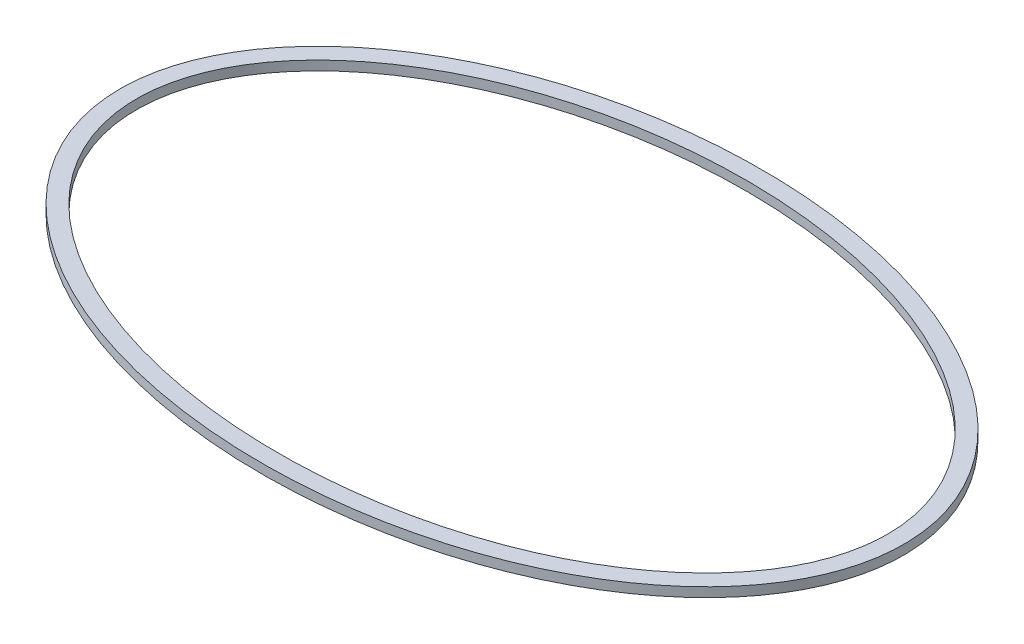
ISO-10303-21;
HEADER;
FILE_DESCRIPTION(('STEP AP214'),'2;1');
FILE_NAME('part.step','',(''),(''),'','','');
FILE_SCHEMA(('AUTOMOTIVE_DESIGN { 1 0 10303 214 1 1 1 1 }'));
ENDSEC;
DATA;
#1=APPLICATION_CONTEXT('core data for automotive mechanical design processes');
#2=APPLICATION_PROTOCOL_DEFINITION('international standard','automotive_design',2000,#1);
#3=PRODUCT_CONTEXT('',#1,'mechanical');
#4=PRODUCT('Part','Part','',(#3));
#5=PRODUCT_RELATED_PRODUCT_CATEGORY('part','',(#4));
#6=PRODUCT_DEFINITION_FORMATION('','',#4);
#7=PRODUCT_DEFINITION_CONTEXT('part definition',#1,'design');
#8=PRODUCT_DEFINITION('design','',#6,#7);
#9=PRODUCT_DEFINITION_SHAPE('','',#8);
#10=(LENGTH_UNIT() NAMED_UNIT(*) SI_UNIT(.MILLI.,.METRE.));
#11=(NAMED_UNIT(*) PLANE_ANGLE_UNIT() SI_UNIT($,.RADIAN.));
#12=(NAMED_UNIT(*) SI_UNIT($,.STERADIAN.) SOLID_ANGLE_UNIT());
#13=UNCERTAINTY_MEASURE_WITH_UNIT(LENGTH_MEASURE(1.E-05),#10,'distance_accuracy_value','');
#14=(GEOMETRIC_REPRESENTATION_CONTEXT(3) GLOBAL_UNCERTAINTY_ASSIGNED_CONTEXT((#13)) GLOBAL_UNIT_ASSIGNED_CONTEXT((#10,
#11,#12)) REPRESENTATION_CONTEXT('',''));
#15=CARTESIAN_POINT('',(0.,0.,0.));
#16=DIRECTION('',(0.,0.,1.));
#17=DIRECTION('',(1.,0.,0.));
#18=AXIS2_PLACEMENT_3D('',#15,#16,#17);
#19=CARTESIAN_POINT('',(-105.495636858508,5.,-43.4585544016999));
#20=DIRECTION('',(0.,1.,0.));
#21=DIRECTION('',(0.,0.,1.));
#22=AXIS2_PLACEMENT_3D('',#19,#20,#21);
#23=PLANE('',#22);
#24=CARTESIAN_POINT('',(-105.495636858508,5.,-43.4585544016999));
#25=DIRECTION('',(0.,1.,0.));
#26=DIRECTION('',(-0.99998528898335,0.,-0.0054241881315449));
#27=AXIS2_PLACEMENT_3D('',#24,#25,#26);
#28=ELLIPSE('',#27,208.98326745558,134.001971305231);
#29=CARTESIAN_POINT('',(-314.475829957761,5.,-44.5921189607239));
#30=VERTEX_POINT('',#29);
#31=EDGE_CURVE('E10',#30,#30,#28,.T.);
#32=ORIENTED_EDGE('',*,*,#31,.T.);
#33=EDGE_LOOP('',(#32));
#34=FACE_BOUND('',#33,.T.);
#35=CARTESIAN_POINT('',(-105.495636858508,5.,-43.4585544016999));
#36=DIRECTION('',(0.,1.,0.));
#37=DIRECTION('',(0.999996398136,0.,0.00268397373814185));
#38=AXIS2_PLACEMENT_3D('',#35,#36,#37);
#39=ELLIPSE('',#38,200.000720375395,125.000450234622);
#40=CARTESIAN_POINT('',(94.5043631414922,5.,-42.9217577206029));
#41=VERTEX_POINT('',#40);
#42=EDGE_CURVE('E50',#41,#41,#39,.T.);
#43=ORIENTED_EDGE('',*,*,#42,.F.);
#44=EDGE_LOOP('',(#43));
#45=FACE_BOUND('',#44,.T.);
#46=ADVANCED_FACE('F37',(#34,#45),#23,.T.);
#47=CARTESIAN_POINT('',(-105.495636858508,0.,-43.4585544016999));
#48=DIRECTION('',(0.,1.,0.));
#49=DIRECTION('',(0.,0.,1.));
#50=AXIS2_PLACEMENT_3D('',#47,#48,#49);
#51=PLANE('',#50);
#52=CARTESIAN_POINT('',(-105.495636858508,0.,-43.4585544016999));
#53=DIRECTION('',(0.,1.,0.));
#54=DIRECTION('',(-0.99998528898335,0.,-0.0054241881315449));
#55=AXIS2_PLACEMENT_3D('',#52,#53,#54);
#56=ELLIPSE('',#55,208.98326745558,134.001971305231);
#57=CARTESIAN_POINT('',(-314.475829957761,0.,-44.5921189607239));
#58=VERTEX_POINT('',#57);
#59=EDGE_CURVE('E42',#58,#58,#56,.T.);
#60=ORIENTED_EDGE('',*,*,#59,.F.);
#61=EDGE_LOOP('',(#60));
#62=FACE_BOUND('',#61,.T.);
#63=CARTESIAN_POINT('',(-105.495636858508,0.,-43.4585544016999));
#64=DIRECTION('',(0.,1.,0.));
#65=DIRECTION('',(0.999996398136,0.,0.00268397373814185));
#66=AXIS2_PLACEMENT_3D('',#63,#64,#65);
#67=ELLIPSE('',#66,200.000720375395,125.000450234622);
#68=CARTESIAN_POINT('',(94.5043631414922,0.,-42.9217577206029));
#69=VERTEX_POINT('',#68);
#70=EDGE_CURVE('E53',#69,#69,#67,.T.);
#71=ORIENTED_EDGE('',*,*,#70,.T.);
#72=EDGE_LOOP('',(#71));
#73=FACE_BOUND('',#72,.T.);
#74=ADVANCED_FACE('F66',(#62,#73),#51,.F.);
#75=DIRECTION('',(0.,-1.,0.));
#76=VECTOR('',#75,1.);
#77=SURFACE_OF_LINEAR_EXTRUSION('',#28,#76);
#78=ORIENTED_EDGE('',*,*,#31,.F.);
#79=EDGE_LOOP('',(#78));
#80=FACE_BOUND('',#79,.T.);
#81=ORIENTED_EDGE('',*,*,#59,.T.);
#82=EDGE_LOOP('',(#81));
#83=FACE_BOUND('',#82,.T.);
#84=ADVANCED_FACE('F39',(#80,#83),#77,.F.);
#85=DIRECTION('',(0.,-1.,0.));
#86=VECTOR('',#85,1.);
#87=SURFACE_OF_LINEAR_EXTRUSION('',#39,#86);
#88=ORIENTED_EDGE('',*,*,#42,.T.);
#89=EDGE_LOOP('',(#88));
#90=FACE_BOUND('',#89,.T.);
#91=ORIENTED_EDGE('',*,*,#70,.F.);
#92=EDGE_LOOP('',(#91));
#93=FACE_BOUND('',#92,.T.);
#94=ADVANCED_FACE('F61',(#90,#93),#87,.T.);
#95=CLOSED_SHELL('',(#46,#74,#84,#94));
#96=MANIFOLD_SOLID_BREP('B2',#95);
#97=ADVANCED_BREP_SHAPE_REPRESENTATION('',(#18,#96),#14);
#98=SHAPE_DEFINITION_REPRESENTATION(#9,#97);
ENDSEC;
END-ISO-10303-21;
